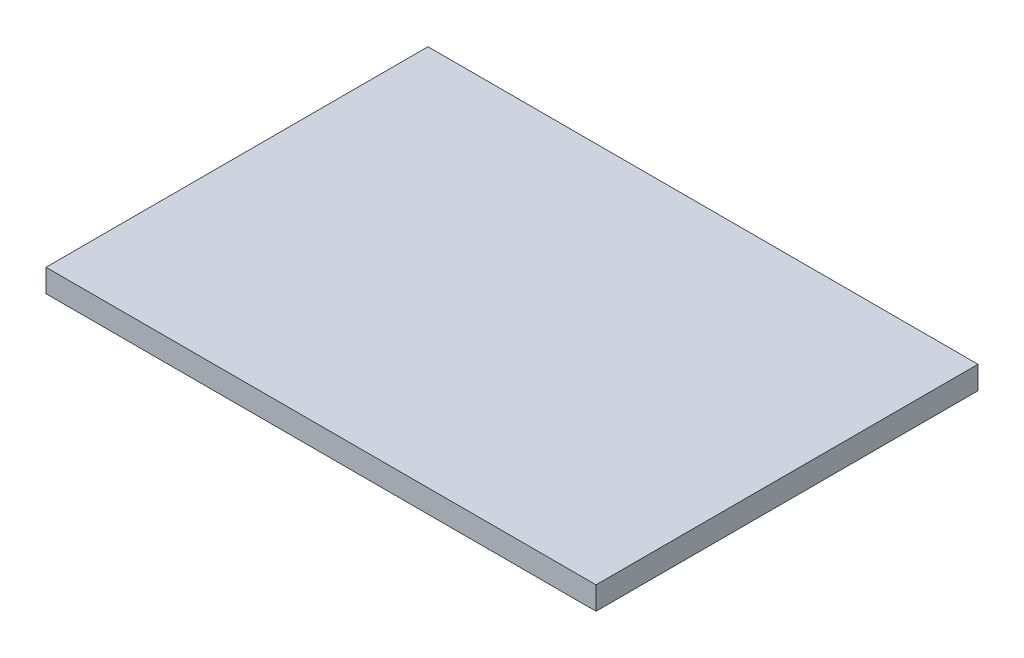
ISO-10303-21;
HEADER;
FILE_DESCRIPTION(('STEP AP214'),'2;1');
FILE_NAME('part.step','',(''),(''),'','','');
FILE_SCHEMA(('AUTOMOTIVE_DESIGN { 1 0 10303 214 1 1 1 1 }'));
ENDSEC;
DATA;
#1=APPLICATION_CONTEXT('core data for automotive mechanical design processes');
#2=APPLICATION_PROTOCOL_DEFINITION('international standard','automotive_design',2000,#1);
#3=PRODUCT_CONTEXT('',#1,'mechanical');
#4=PRODUCT('Part','Part','',(#3));
#5=PRODUCT_RELATED_PRODUCT_CATEGORY('part','',(#4));
#6=PRODUCT_DEFINITION_FORMATION('','',#4);
#7=PRODUCT_DEFINITION_CONTEXT('part definition',#1,'design');
#8=PRODUCT_DEFINITION('design','',#6,#7);
#9=PRODUCT_DEFINITION_SHAPE('','',#8);
#10=(LENGTH_UNIT() NAMED_UNIT(*) SI_UNIT(.MILLI.,.METRE.));
#11=(NAMED_UNIT(*) PLANE_ANGLE_UNIT() SI_UNIT($,.RADIAN.));
#12=(NAMED_UNIT(*) SI_UNIT($,.STERADIAN.) SOLID_ANGLE_UNIT());
#13=UNCERTAINTY_MEASURE_WITH_UNIT(LENGTH_MEASURE(1.E-05),#10,'distance_accuracy_value','');
#14=(GEOMETRIC_REPRESENTATION_CONTEXT(3) GLOBAL_UNCERTAINTY_ASSIGNED_CONTEXT((#13)) GLOBAL_UNIT_ASSIGNED_CONTEXT((#10,
#11,#12)) REPRESENTATION_CONTEXT('',''));
#15=CARTESIAN_POINT('',(0.,0.,0.));
#16=DIRECTION('',(0.,0.,1.));
#17=DIRECTION('',(1.,0.,0.));
#18=AXIS2_PLACEMENT_3D('',#15,#16,#17);
#19=CARTESIAN_POINT('',(36.,3.,-25.));
#20=DIRECTION('',(-1.,0.,0.));
#21=DIRECTION('',(0.,0.,1.));
#22=AXIS2_PLACEMENT_3D('',#19,#20,#21);
#23=PLANE('',#22);
#24=DIRECTION('',(0.,0.,-1.));
#25=VECTOR('',#24,1.);
#26=CARTESIAN_POINT('',(36.,0.,-25.));
#27=LINE('',#26,#25);
#28=CARTESIAN_POINT('',(36.,0.,25.));
#29=VERTEX_POINT('',#28);
#30=CARTESIAN_POINT('',(36.,0.,-25.));
#31=VERTEX_POINT('',#30);
#32=EDGE_CURVE('E99',#29,#31,#27,.T.);
#33=ORIENTED_EDGE('',*,*,#32,.T.);
#34=DIRECTION('',(0.,-1.,0.));
#35=VECTOR('',#34,1.);
#36=CARTESIAN_POINT('',(36.,3.,-25.));
#37=LINE('',#36,#35);
#38=CARTESIAN_POINT('',(36.,3.,-25.));
#39=VERTEX_POINT('',#38);
#40=EDGE_CURVE('E11',#39,#31,#37,.T.);
#41=ORIENTED_EDGE('',*,*,#40,.F.);
#42=DIRECTION('',(0.,0.,-1.));
#43=VECTOR('',#42,1.);
#44=CARTESIAN_POINT('',(36.,3.,-25.));
#45=LINE('',#44,#43);
#46=CARTESIAN_POINT('',(36.,3.,25.));
#47=VERTEX_POINT('',#46);
#48=EDGE_CURVE('E87',#47,#39,#45,.T.);
#49=ORIENTED_EDGE('',*,*,#48,.F.);
#50=DIRECTION('',(0.,-1.,0.));
#51=VECTOR('',#50,1.);
#52=CARTESIAN_POINT('',(36.,3.,25.));
#53=LINE('',#52,#51);
#54=EDGE_CURVE('E95',#47,#29,#53,.T.);
#55=ORIENTED_EDGE('',*,*,#54,.T.);
#56=EDGE_LOOP('',(#33,#41,#49,#55));
#57=FACE_BOUND('',#56,.T.);
#58=ADVANCED_FACE('F36',(#57),#23,.F.);
#59=CARTESIAN_POINT('',(-36.,3.,-25.));
#60=DIRECTION('',(0.,0.,1.));
#61=DIRECTION('',(1.,0.,0.));
#62=AXIS2_PLACEMENT_3D('',#59,#60,#61);
#63=PLANE('',#62);
#64=DIRECTION('',(-1.,0.,0.));
#65=VECTOR('',#64,1.);
#66=CARTESIAN_POINT('',(-36.,0.,-25.));
#67=LINE('',#66,#65);
#68=CARTESIAN_POINT('',(-36.,0.,-25.));
#69=VERTEX_POINT('',#68);
#70=EDGE_CURVE('E91',#31,#69,#67,.T.);
#71=ORIENTED_EDGE('',*,*,#70,.T.);
#72=DIRECTION('',(0.,-1.,0.));
#73=VECTOR('',#72,1.);
#74=CARTESIAN_POINT('',(-36.,3.,-25.));
#75=LINE('',#74,#73);
#76=CARTESIAN_POINT('',(-36.,3.,-25.));
#77=VERTEX_POINT('',#76);
#78=EDGE_CURVE('E44',#77,#69,#75,.T.);
#79=ORIENTED_EDGE('',*,*,#78,.F.);
#80=DIRECTION('',(-1.,0.,0.));
#81=VECTOR('',#80,1.);
#82=CARTESIAN_POINT('',(-36.,3.,-25.));
#83=LINE('',#82,#81);
#84=EDGE_CURVE('E82',#39,#77,#83,.T.);
#85=ORIENTED_EDGE('',*,*,#84,.F.);
#86=ORIENTED_EDGE('',*,*,#40,.T.);
#87=EDGE_LOOP('',(#71,#79,#85,#86));
#88=FACE_BOUND('',#87,.T.);
#89=ADVANCED_FACE('F90',(#88),#63,.F.);
#90=CARTESIAN_POINT('',(-36.,3.,-25.));
#91=DIRECTION('',(1.,0.,0.));
#92=DIRECTION('',(0.,0.,-1.));
#93=AXIS2_PLACEMENT_3D('',#90,#91,#92);
#94=PLANE('',#93);
#95=DIRECTION('',(0.,0.,1.));
#96=VECTOR('',#95,1.);
#97=CARTESIAN_POINT('',(-36.,0.,-25.));
#98=LINE('',#97,#96);
#99=CARTESIAN_POINT('',(-36.,0.,25.));
#100=VERTEX_POINT('',#99);
#101=EDGE_CURVE('E69',#69,#100,#98,.T.);
#102=ORIENTED_EDGE('',*,*,#101,.T.);
#103=DIRECTION('',(0.,-1.,0.));
#104=VECTOR('',#103,1.);
#105=CARTESIAN_POINT('',(-36.,3.,25.));
#106=LINE('',#105,#104);
#107=CARTESIAN_POINT('',(-36.,3.,25.));
#108=VERTEX_POINT('',#107);
#109=EDGE_CURVE('E92',#108,#100,#106,.T.);
#110=ORIENTED_EDGE('',*,*,#109,.F.);
#111=DIRECTION('',(0.,0.,1.));
#112=VECTOR('',#111,1.);
#113=CARTESIAN_POINT('',(-36.,3.,-25.));
#114=LINE('',#113,#112);
#115=EDGE_CURVE('E85',#77,#108,#114,.T.);
#116=ORIENTED_EDGE('',*,*,#115,.F.);
#117=ORIENTED_EDGE('',*,*,#78,.T.);
#118=EDGE_LOOP('',(#102,#110,#116,#117));
#119=FACE_BOUND('',#118,.T.);
#120=ADVANCED_FACE('F93',(#119),#94,.F.);
#121=CARTESIAN_POINT('',(-36.,3.,25.));
#122=DIRECTION('',(0.,0.,-1.));
#123=DIRECTION('',(-1.,0.,0.));
#124=AXIS2_PLACEMENT_3D('',#121,#122,#123);
#125=PLANE('',#124);
#126=DIRECTION('',(1.,0.,0.));
#127=VECTOR('',#126,1.);
#128=CARTESIAN_POINT('',(-36.,0.,25.));
#129=LINE('',#128,#127);
#130=EDGE_CURVE('E75',#100,#29,#129,.T.);
#131=ORIENTED_EDGE('',*,*,#130,.T.);
#132=ORIENTED_EDGE('',*,*,#54,.F.);
#133=DIRECTION('',(1.,0.,0.));
#134=VECTOR('',#133,1.);
#135=CARTESIAN_POINT('',(-36.,3.,25.));
#136=LINE('',#135,#134);
#137=EDGE_CURVE('E52',#108,#47,#136,.T.);
#138=ORIENTED_EDGE('',*,*,#137,.F.);
#139=ORIENTED_EDGE('',*,*,#109,.T.);
#140=EDGE_LOOP('',(#131,#132,#138,#139));
#141=FACE_BOUND('',#140,.T.);
#142=ADVANCED_FACE('F106',(#141),#125,.F.);
#143=CARTESIAN_POINT('',(0.,3.,0.));
#144=DIRECTION('',(0.,1.,0.));
#145=DIRECTION('',(0.,0.,1.));
#146=AXIS2_PLACEMENT_3D('',#143,#144,#145);
#147=PLANE('',#146);
#148=ORIENTED_EDGE('',*,*,#48,.T.);
#149=ORIENTED_EDGE('',*,*,#84,.T.);
#150=ORIENTED_EDGE('',*,*,#115,.T.);
#151=ORIENTED_EDGE('',*,*,#137,.T.);
#152=EDGE_LOOP('',(#148,#149,#150,#151));
#153=FACE_BOUND('',#152,.T.);
#154=ADVANCED_FACE('F83',(#153),#147,.T.);
#155=CARTESIAN_POINT('',(0.,0.,0.));
#156=DIRECTION('',(0.,1.,0.));
#157=DIRECTION('',(0.,0.,1.));
#158=AXIS2_PLACEMENT_3D('',#155,#156,#157);
#159=PLANE('',#158);
#160=ORIENTED_EDGE('',*,*,#32,.F.);
#161=ORIENTED_EDGE('',*,*,#130,.F.);
#162=ORIENTED_EDGE('',*,*,#101,.F.);
#163=ORIENTED_EDGE('',*,*,#70,.F.);
#164=EDGE_LOOP('',(#160,#161,#162,#163));
#165=FACE_BOUND('',#164,.T.);
#166=ADVANCED_FACE('F109',(#165),#159,.F.);
#167=CLOSED_SHELL('',(#58,#89,#120,#142,#154,#166));
#168=MANIFOLD_SOLID_BREP('B2',#167);
#169=ADVANCED_BREP_SHAPE_REPRESENTATION('',(#18,#168),#14);
#170=SHAPE_DEFINITION_REPRESENTATION(#9,#169);
ENDSEC;
END-ISO-10303-21;
